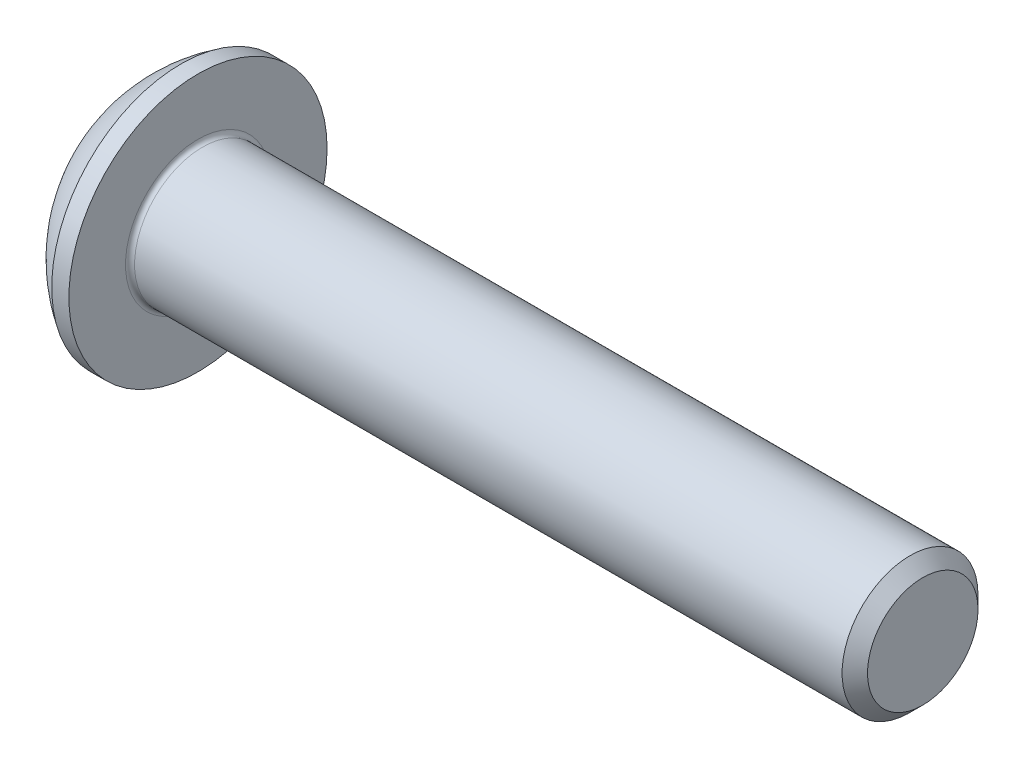
ISO-10303-21;
HEADER;
FILE_DESCRIPTION(('STEP AP214'),'2;1');
FILE_NAME('part.step','',(''),(''),'','','');
FILE_SCHEMA(('AUTOMOTIVE_DESIGN { 1 0 10303 214 1 1 1 1 }'));
ENDSEC;
DATA;
#1=APPLICATION_CONTEXT('core data for automotive mechanical design processes');
#2=APPLICATION_PROTOCOL_DEFINITION('international standard','automotive_design',2000,#1);
#3=PRODUCT_CONTEXT('',#1,'mechanical');
#4=PRODUCT('Part','Part','',(#3));
#5=PRODUCT_RELATED_PRODUCT_CATEGORY('part','',(#4));
#6=PRODUCT_DEFINITION_FORMATION('','',#4);
#7=PRODUCT_DEFINITION_CONTEXT('part definition',#1,'design');
#8=PRODUCT_DEFINITION('design','',#6,#7);
#9=PRODUCT_DEFINITION_SHAPE('','',#8);
#10=(LENGTH_UNIT() NAMED_UNIT(*) SI_UNIT(.MILLI.,.METRE.));
#11=(NAMED_UNIT(*) PLANE_ANGLE_UNIT() SI_UNIT($,.RADIAN.));
#12=(NAMED_UNIT(*) SI_UNIT($,.STERADIAN.) SOLID_ANGLE_UNIT());
#13=UNCERTAINTY_MEASURE_WITH_UNIT(LENGTH_MEASURE(1.E-05),#10,'distance_accuracy_value','');
#14=(GEOMETRIC_REPRESENTATION_CONTEXT(3) GLOBAL_UNCERTAINTY_ASSIGNED_CONTEXT((#13)) GLOBAL_UNIT_ASSIGNED_CONTEXT((#10,
#11,#12)) REPRESENTATION_CONTEXT('',''));
#15=CARTESIAN_POINT('',(0.,0.,0.));
#16=DIRECTION('',(0.,0.,1.));
#17=DIRECTION('',(1.,0.,0.));
#18=AXIS2_PLACEMENT_3D('',#15,#16,#17);
#19=CARTESIAN_POINT('',(3.03181051518725,0.,0.));
#20=DIRECTION('',(1.,0.,0.));
#21=DIRECTION('',(0.,1.,0.));
#22=AXIS2_PLACEMENT_3D('',#19,#20,#21);
#23=SPHERICAL_SURFACE('',#22,3.35);
#24=CARTESIAN_POINT('',(0.,0.,0.));
#25=DIRECTION('',(1.,0.,0.));
#26=DIRECTION('',(0.,0.,-1.));
#27=AXIS2_PLACEMENT_3D('',#24,#25,#26);
#28=CIRCLE('',#27,1.425);
#29=CARTESIAN_POINT('',(0.,0.,-1.425));
#30=VERTEX_POINT('',#29);
#31=EDGE_CURVE('E189',#30,#30,#28,.T.);
#32=ORIENTED_EDGE('',*,*,#31,.T.);
#33=EDGE_LOOP('',(#32));
#34=FACE_BOUND('',#33,.T.);
#35=CARTESIAN_POINT('',(1.27112882902135,0.,0.));
#36=DIRECTION('',(1.,0.,0.));
#37=DIRECTION('',(0.,0.,-1.));
#38=AXIS2_PLACEMENT_3D('',#35,#36,#37);
#39=CIRCLE('',#38,2.85);
#40=CARTESIAN_POINT('',(1.27112882902135,0.,-2.85));
#41=VERTEX_POINT('',#40);
#42=EDGE_CURVE('E176',#41,#41,#39,.T.);
#43=ORIENTED_EDGE('',*,*,#42,.F.);
#44=EDGE_LOOP('',(#43));
#45=FACE_BOUND('',#44,.T.);
#46=ADVANCED_FACE('F34',(#34,#45),#23,.T.);
#47=CARTESIAN_POINT('',(0.,1.425,0.));
#48=DIRECTION('',(-1.,0.,0.));
#49=DIRECTION('',(0.,0.,1.));
#50=AXIS2_PLACEMENT_3D('',#47,#48,#49);
#51=PLANE('',#50);
#52=DIRECTION('',(0.,0.5,-0.866025403784439));
#53=VECTOR('',#52,1.);
#54=CARTESIAN_POINT('',(0.,0.577350269189626,1.));
#55=LINE('',#54,#53);
#56=CARTESIAN_POINT('',(0.,0.577350269189626,1.));
#57=VERTEX_POINT('',#56);
#58=CARTESIAN_POINT('',(0.,1.15470053837925,0.));
#59=VERTEX_POINT('',#58);
#60=EDGE_CURVE('E156',#57,#59,#55,.T.);
#61=ORIENTED_EDGE('',*,*,#60,.F.);
#62=DIRECTION('',(0.,1.,0.));
#63=VECTOR('',#62,1.);
#64=CARTESIAN_POINT('',(0.,-0.577350269189626,1.));
#65=LINE('',#64,#63);
#66=CARTESIAN_POINT('',(0.,-0.577350269189626,1.));
#67=VERTEX_POINT('',#66);
#68=EDGE_CURVE('E153',#67,#57,#65,.T.);
#69=ORIENTED_EDGE('',*,*,#68,.F.);
#70=DIRECTION('',(0.,0.5,0.866025403784439));
#71=VECTOR('',#70,1.);
#72=CARTESIAN_POINT('',(0.,-1.15470053837925,0.));
#73=LINE('',#72,#71);
#74=CARTESIAN_POINT('',(0.,-1.15470053837925,0.));
#75=VERTEX_POINT('',#74);
#76=EDGE_CURVE('E151',#75,#67,#73,.T.);
#77=ORIENTED_EDGE('',*,*,#76,.F.);
#78=DIRECTION('',(0.,-0.5,0.866025403784438));
#79=VECTOR('',#78,1.);
#80=CARTESIAN_POINT('',(0.,-0.577350269189625,-1.));
#81=LINE('',#80,#79);
#82=CARTESIAN_POINT('',(0.,-0.577350269189625,-1.));
#83=VERTEX_POINT('',#82);
#84=EDGE_CURVE('E149',#83,#75,#81,.T.);
#85=ORIENTED_EDGE('',*,*,#84,.F.);
#86=DIRECTION('',(0.,-1.,0.));
#87=VECTOR('',#86,1.);
#88=CARTESIAN_POINT('',(0.,0.577350269189626,-1.));
#89=LINE('',#88,#87);
#90=CARTESIAN_POINT('',(0.,0.577350269189626,-1.));
#91=VERTEX_POINT('',#90);
#92=EDGE_CURVE('E123',#91,#83,#89,.T.);
#93=ORIENTED_EDGE('',*,*,#92,.F.);
#94=DIRECTION('',(0.,-0.5,-0.866025403784439));
#95=VECTOR('',#94,1.);
#96=CARTESIAN_POINT('',(0.,1.15470053837925,0.));
#97=LINE('',#96,#95);
#98=EDGE_CURVE('E116',#59,#91,#97,.T.);
#99=ORIENTED_EDGE('',*,*,#98,.F.);
#100=EDGE_LOOP('',(#61,#69,#77,#85,#93,#99));
#101=FACE_BOUND('',#100,.T.);
#102=ORIENTED_EDGE('',*,*,#31,.F.);
#103=EDGE_LOOP('',(#102));
#104=FACE_BOUND('',#103,.T.);
#105=ADVANCED_FACE('F211',(#101,#104),#51,.T.);
#106=CARTESIAN_POINT('',(17.65,0.,0.));
#107=DIRECTION('',(1.,0.,0.));
#108=DIRECTION('',(0.,0.,-1.));
#109=AXIS2_PLACEMENT_3D('',#106,#107,#108);
#110=PLANE('',#109);
#111=CARTESIAN_POINT('',(17.65,0.,0.));
#112=DIRECTION('',(1.,0.,0.));
#113=DIRECTION('',(0.,0.,-1.));
#114=AXIS2_PLACEMENT_3D('',#111,#112,#113);
#115=CIRCLE('',#114,1.2195);
#116=CARTESIAN_POINT('',(17.65,0.,-1.2195));
#117=VERTEX_POINT('',#116);
#118=EDGE_CURVE('E186',#117,#117,#115,.T.);
#119=ORIENTED_EDGE('',*,*,#118,.T.);
#120=EDGE_LOOP('',(#119));
#121=FACE_BOUND('',#120,.T.);
#122=ADVANCED_FACE('F216',(#121),#110,.T.);
#123=CARTESIAN_POINT('',(17.65,0.,0.));
#124=DIRECTION('',(-1.,0.,0.));
#125=DIRECTION('',(0.,0.,1.));
#126=AXIS2_PLACEMENT_3D('',#123,#124,#125);
#127=CONICAL_SURFACE('',#126,1.2195,0.785398163397449);
#128=CARTESIAN_POINT('',(17.3695,0.,0.));
#129=DIRECTION('',(1.,0.,0.));
#130=DIRECTION('',(0.,0.,-1.));
#131=AXIS2_PLACEMENT_3D('',#128,#129,#130);
#132=CIRCLE('',#131,1.5);
#133=CARTESIAN_POINT('',(17.3695,0.,-1.5));
#134=VERTEX_POINT('',#133);
#135=EDGE_CURVE('E183',#134,#134,#132,.T.);
#136=ORIENTED_EDGE('',*,*,#135,.T.);
#137=EDGE_LOOP('',(#136));
#138=FACE_BOUND('',#137,.T.);
#139=ORIENTED_EDGE('',*,*,#118,.F.);
#140=EDGE_LOOP('',(#139));
#141=FACE_BOUND('',#140,.T.);
#142=ADVANCED_FACE('F223',(#138,#141),#127,.T.);
#143=CARTESIAN_POINT('',(-3.64348996551984,0.,0.));
#144=DIRECTION('',(1.,0.,0.));
#145=DIRECTION('',(0.,0.,-1.));
#146=AXIS2_PLACEMENT_3D('',#143,#144,#145);
#147=CYLINDRICAL_SURFACE('',#146,1.5);
#148=CARTESIAN_POINT('',(1.75,0.,0.));
#149=DIRECTION('',(1.,0.,0.));
#150=DIRECTION('',(0.,0.,-1.));
#151=AXIS2_PLACEMENT_3D('',#148,#149,#150);
#152=CIRCLE('',#151,1.5);
#153=CARTESIAN_POINT('',(1.75,0.,-1.5));
#154=VERTEX_POINT('',#153);
#155=EDGE_CURVE('E42',#154,#154,#152,.T.);
#156=ORIENTED_EDGE('',*,*,#155,.T.);
#157=EDGE_LOOP('',(#156));
#158=FACE_BOUND('',#157,.T.);
#159=ORIENTED_EDGE('',*,*,#135,.F.);
#160=EDGE_LOOP('',(#159));
#161=FACE_BOUND('',#160,.T.);
#162=ADVANCED_FACE('F194',(#158,#161),#147,.T.);
#163=CARTESIAN_POINT('',(1.65,1.5,0.));
#164=DIRECTION('',(1.,0.,0.));
#165=DIRECTION('',(0.,0.,-1.));
#166=AXIS2_PLACEMENT_3D('',#163,#164,#165);
#167=PLANE('',#166);
#168=CARTESIAN_POINT('',(1.65,0.,0.));
#169=DIRECTION('',(1.,0.,0.));
#170=DIRECTION('',(0.,0.,-1.));
#171=AXIS2_PLACEMENT_3D('',#168,#169,#170);
#172=CIRCLE('',#171,1.6);
#173=CARTESIAN_POINT('',(1.65,0.,-1.6));
#174=VERTEX_POINT('',#173);
#175=EDGE_CURVE('E11',#174,#174,#172,.F.);
#176=ORIENTED_EDGE('',*,*,#175,.T.);
#177=EDGE_LOOP('',(#176));
#178=FACE_BOUND('',#177,.T.);
#179=CARTESIAN_POINT('',(1.65,0.,0.));
#180=DIRECTION('',(1.,0.,0.));
#181=DIRECTION('',(0.,0.,-1.));
#182=AXIS2_PLACEMENT_3D('',#179,#180,#181);
#183=CIRCLE('',#182,2.85);
#184=CARTESIAN_POINT('',(1.65,0.,-2.85));
#185=VERTEX_POINT('',#184);
#186=EDGE_CURVE('E180',#185,#185,#183,.T.);
#187=ORIENTED_EDGE('',*,*,#186,.T.);
#188=EDGE_LOOP('',(#187));
#189=FACE_BOUND('',#188,.T.);
#190=ADVANCED_FACE('F206',(#178,#189),#167,.T.);
#191=CARTESIAN_POINT('',(-3.64348996551984,0.,0.));
#192=DIRECTION('',(1.,0.,0.));
#193=DIRECTION('',(0.,0.,-1.));
#194=AXIS2_PLACEMENT_3D('',#191,#192,#193);
#195=CYLINDRICAL_SURFACE('',#194,2.85);
#196=ORIENTED_EDGE('',*,*,#42,.T.);
#197=EDGE_LOOP('',(#196));
#198=FACE_BOUND('',#197,.T.);
#199=ORIENTED_EDGE('',*,*,#186,.F.);
#200=EDGE_LOOP('',(#199));
#201=FACE_BOUND('',#200,.T.);
#202=ADVANCED_FACE('F198',(#198,#201),#195,.T.);
#203=CARTESIAN_POINT('',(1.75,0.,0.));
#204=DIRECTION('',(1.,0.,0.));
#205=DIRECTION('',(0.,0.,-1.));
#206=AXIS2_PLACEMENT_3D('',#203,#204,#205);
#207=TOROIDAL_SURFACE('',#206,1.6,0.1);
#208=ORIENTED_EDGE('',*,*,#175,.F.);
#209=EDGE_LOOP('',(#208));
#210=FACE_BOUND('',#209,.T.);
#211=ORIENTED_EDGE('',*,*,#155,.F.);
#212=EDGE_LOOP('',(#211));
#213=FACE_BOUND('',#212,.T.);
#214=ADVANCED_FACE('F36',(#210,#213),#207,.F.);
#215=CARTESIAN_POINT('',(1.04,0.577350269189626,-1.));
#216=DIRECTION('',(0.,0.,-1.));
#217=DIRECTION('',(0.,1.,0.));
#218=AXIS2_PLACEMENT_3D('',#215,#216,#217);
#219=PLANE('',#218);
#220=DIRECTION('',(0.,-1.,0.));
#221=VECTOR('',#220,1.);
#222=CARTESIAN_POINT('',(1.04,0.577350269189626,-1.));
#223=LINE('',#222,#221);
#224=CARTESIAN_POINT('',(1.04,0.577350269189626,-1.));
#225=VERTEX_POINT('',#224);
#226=CARTESIAN_POINT('',(1.04,0.,-1.));
#227=VERTEX_POINT('',#226);
#228=EDGE_CURVE('E115',#225,#227,#223,.T.);
#229=ORIENTED_EDGE('',*,*,#228,.F.);
#230=DIRECTION('',(-1.,0.,0.));
#231=VECTOR('',#230,1.);
#232=CARTESIAN_POINT('',(1.04,0.577350269189626,-1.));
#233=LINE('',#232,#231);
#234=EDGE_CURVE('E161',#225,#91,#233,.T.);
#235=ORIENTED_EDGE('',*,*,#234,.T.);
#236=ORIENTED_EDGE('',*,*,#92,.T.);
#237=DIRECTION('',(-1.,0.,0.));
#238=VECTOR('',#237,1.);
#239=CARTESIAN_POINT('',(1.04,-0.577350269189625,-1.));
#240=LINE('',#239,#238);
#241=CARTESIAN_POINT('',(1.04,-0.577350269189625,-1.));
#242=VERTEX_POINT('',#241);
#243=EDGE_CURVE('E120',#242,#83,#240,.T.);
#244=ORIENTED_EDGE('',*,*,#243,.F.);
#245=EDGE_CURVE('E105',#227,#242,#223,.T.);
#246=ORIENTED_EDGE('',*,*,#245,.F.);
#247=EDGE_LOOP('',(#229,#235,#236,#244,#246));
#248=FACE_BOUND('',#247,.T.);
#249=ADVANCED_FACE('F121',(#248),#219,.F.);
#250=CARTESIAN_POINT('',(1.04,1.15470053837925,0.));
#251=DIRECTION('',(0.,0.866025403784439,-0.5));
#252=DIRECTION('',(0.,0.5,0.866025403784439));
#253=AXIS2_PLACEMENT_3D('',#250,#251,#252);
#254=PLANE('',#253);
#255=DIRECTION('',(0.,-0.5,-0.866025403784439));
#256=VECTOR('',#255,1.);
#257=CARTESIAN_POINT('',(1.04,1.15470053837925,0.));
#258=LINE('',#257,#256);
#259=CARTESIAN_POINT('',(1.04,1.15470053837925,0.));
#260=VERTEX_POINT('',#259);
#261=CARTESIAN_POINT('',(1.04,0.866025403784439,-0.500000000000001));
#262=VERTEX_POINT('',#261);
#263=EDGE_CURVE('E127',#260,#262,#258,.T.);
#264=ORIENTED_EDGE('',*,*,#263,.F.);
#265=DIRECTION('',(-1.,0.,0.));
#266=VECTOR('',#265,1.);
#267=CARTESIAN_POINT('',(1.04,1.15470053837925,0.));
#268=LINE('',#267,#266);
#269=EDGE_CURVE('E163',#260,#59,#268,.T.);
#270=ORIENTED_EDGE('',*,*,#269,.T.);
#271=ORIENTED_EDGE('',*,*,#98,.T.);
#272=ORIENTED_EDGE('',*,*,#234,.F.);
#273=EDGE_CURVE('E145',#262,#225,#258,.T.);
#274=ORIENTED_EDGE('',*,*,#273,.F.);
#275=EDGE_LOOP('',(#264,#270,#271,#272,#274));
#276=FACE_BOUND('',#275,.T.);
#277=ADVANCED_FACE('F204',(#276),#254,.F.);
#278=CARTESIAN_POINT('',(1.04,0.577350269189626,1.));
#279=DIRECTION('',(0.,0.866025403784439,0.5));
#280=DIRECTION('',(0.,-0.5,0.866025403784439));
#281=AXIS2_PLACEMENT_3D('',#278,#279,#280);
#282=PLANE('',#281);
#283=DIRECTION('',(0.,0.5,-0.866025403784439));
#284=VECTOR('',#283,1.);
#285=CARTESIAN_POINT('',(1.04,0.577350269189626,1.));
#286=LINE('',#285,#284);
#287=CARTESIAN_POINT('',(1.04,0.577350269189626,1.));
#288=VERTEX_POINT('',#287);
#289=CARTESIAN_POINT('',(1.04,0.866025403784438,0.5));
#290=VERTEX_POINT('',#289);
#291=EDGE_CURVE('E49',#288,#290,#286,.T.);
#292=ORIENTED_EDGE('',*,*,#291,.F.);
#293=DIRECTION('',(-1.,0.,0.));
#294=VECTOR('',#293,1.);
#295=CARTESIAN_POINT('',(1.04,0.577350269189626,1.));
#296=LINE('',#295,#294);
#297=EDGE_CURVE('E166',#288,#57,#296,.T.);
#298=ORIENTED_EDGE('',*,*,#297,.T.);
#299=ORIENTED_EDGE('',*,*,#60,.T.);
#300=ORIENTED_EDGE('',*,*,#269,.F.);
#301=EDGE_CURVE('E143',#290,#260,#286,.T.);
#302=ORIENTED_EDGE('',*,*,#301,.F.);
#303=EDGE_LOOP('',(#292,#298,#299,#300,#302));
#304=FACE_BOUND('',#303,.T.);
#305=ADVANCED_FACE('F248',(#304),#282,.F.);
#306=CARTESIAN_POINT('',(1.04,-0.577350269189626,1.));
#307=DIRECTION('',(0.,0.,1.));
#308=DIRECTION('',(1.,0.,0.));
#309=AXIS2_PLACEMENT_3D('',#306,#307,#308);
#310=PLANE('',#309);
#311=DIRECTION('',(0.,1.,0.));
#312=VECTOR('',#311,1.);
#313=CARTESIAN_POINT('',(1.04,-0.577350269189626,1.));
#314=LINE('',#313,#312);
#315=CARTESIAN_POINT('',(1.04,-0.577350269189626,1.));
#316=VERTEX_POINT('',#315);
#317=CARTESIAN_POINT('',(1.04,0.,1.));
#318=VERTEX_POINT('',#317);
#319=EDGE_CURVE('E140',#316,#318,#314,.T.);
#320=ORIENTED_EDGE('',*,*,#319,.F.);
#321=DIRECTION('',(-1.,0.,0.));
#322=VECTOR('',#321,1.);
#323=CARTESIAN_POINT('',(1.04,-0.577350269189626,1.));
#324=LINE('',#323,#322);
#325=EDGE_CURVE('E169',#316,#67,#324,.T.);
#326=ORIENTED_EDGE('',*,*,#325,.T.);
#327=ORIENTED_EDGE('',*,*,#68,.T.);
#328=ORIENTED_EDGE('',*,*,#297,.F.);
#329=EDGE_CURVE('E139',#318,#288,#314,.T.);
#330=ORIENTED_EDGE('',*,*,#329,.F.);
#331=EDGE_LOOP('',(#320,#326,#327,#328,#330));
#332=FACE_BOUND('',#331,.T.);
#333=ADVANCED_FACE('F244',(#332),#310,.F.);
#334=CARTESIAN_POINT('',(1.04,-1.15470053837925,0.));
#335=DIRECTION('',(0.,-0.866025403784439,0.5));
#336=DIRECTION('',(0.,-0.5,-0.866025403784439));
#337=AXIS2_PLACEMENT_3D('',#334,#335,#336);
#338=PLANE('',#337);
#339=DIRECTION('',(0.,0.5,0.866025403784439));
#340=VECTOR('',#339,1.);
#341=CARTESIAN_POINT('',(1.04,-1.15470053837925,0.));
#342=LINE('',#341,#340);
#343=CARTESIAN_POINT('',(1.04,-1.15470053837925,0.));
#344=VERTEX_POINT('',#343);
#345=CARTESIAN_POINT('',(1.04,-0.866025403784439,0.5));
#346=VERTEX_POINT('',#345);
#347=EDGE_CURVE('E135',#344,#346,#342,.T.);
#348=ORIENTED_EDGE('',*,*,#347,.F.);
#349=DIRECTION('',(-1.,0.,0.));
#350=VECTOR('',#349,1.);
#351=CARTESIAN_POINT('',(1.04,-1.15470053837925,0.));
#352=LINE('',#351,#350);
#353=EDGE_CURVE('E126',#344,#75,#352,.T.);
#354=ORIENTED_EDGE('',*,*,#353,.T.);
#355=ORIENTED_EDGE('',*,*,#76,.T.);
#356=ORIENTED_EDGE('',*,*,#325,.F.);
#357=EDGE_CURVE('E133',#346,#316,#342,.T.);
#358=ORIENTED_EDGE('',*,*,#357,.F.);
#359=EDGE_LOOP('',(#348,#354,#355,#356,#358));
#360=FACE_BOUND('',#359,.T.);
#361=ADVANCED_FACE('F241',(#360),#338,.F.);
#362=CARTESIAN_POINT('',(1.04,-0.577350269189625,-1.));
#363=DIRECTION('',(0.,-0.866025403784438,-0.5));
#364=DIRECTION('',(0.,0.5,-0.866025403784438));
#365=AXIS2_PLACEMENT_3D('',#362,#363,#364);
#366=PLANE('',#365);
#367=DIRECTION('',(0.,-0.5,0.866025403784438));
#368=VECTOR('',#367,1.);
#369=CARTESIAN_POINT('',(1.04,-0.577350269189625,-1.));
#370=LINE('',#369,#368);
#371=CARTESIAN_POINT('',(1.04,-0.866025403784438,-0.5));
#372=VERTEX_POINT('',#371);
#373=EDGE_CURVE('E109',#242,#372,#370,.T.);
#374=ORIENTED_EDGE('',*,*,#373,.F.);
#375=ORIENTED_EDGE('',*,*,#243,.T.);
#376=ORIENTED_EDGE('',*,*,#84,.T.);
#377=ORIENTED_EDGE('',*,*,#353,.F.);
#378=EDGE_CURVE('E132',#372,#344,#370,.T.);
#379=ORIENTED_EDGE('',*,*,#378,.F.);
#380=EDGE_LOOP('',(#374,#375,#376,#377,#379));
#381=FACE_BOUND('',#380,.T.);
#382=ADVANCED_FACE('F130',(#381),#366,.F.);
#383=CARTESIAN_POINT('',(1.04,0.,0.));
#384=DIRECTION('',(-1.,0.,0.));
#385=DIRECTION('',(0.,0.,1.));
#386=AXIS2_PLACEMENT_3D('',#383,#384,#385);
#387=PLANE('',#386);
#388=CARTESIAN_POINT('',(1.04,0.,0.));
#389=DIRECTION('',(1.,0.,0.));
#390=DIRECTION('',(0.,0.,-1.));
#391=AXIS2_PLACEMENT_3D('',#388,#389,#390);
#392=CIRCLE('',#391,1.);
#393=EDGE_CURVE('E276',#318,#346,#392,.T.);
#394=ORIENTED_EDGE('',*,*,#393,.T.);
#395=ORIENTED_EDGE('',*,*,#357,.T.);
#396=ORIENTED_EDGE('',*,*,#319,.T.);
#397=EDGE_LOOP('',(#394,#395,#396));
#398=FACE_BOUND('',#397,.T.);
#399=ADVANCED_FACE('F240',(#398),#387,.T.);
#400=EDGE_CURVE('E282',#346,#372,#392,.T.);
#401=ORIENTED_EDGE('',*,*,#400,.T.);
#402=ORIENTED_EDGE('',*,*,#378,.T.);
#403=ORIENTED_EDGE('',*,*,#347,.T.);
#404=EDGE_LOOP('',(#401,#402,#403));
#405=FACE_BOUND('',#404,.T.);
#406=ADVANCED_FACE('F257',(#405),#387,.T.);
#407=EDGE_CURVE('E111',#372,#227,#392,.T.);
#408=ORIENTED_EDGE('',*,*,#407,.T.);
#409=ORIENTED_EDGE('',*,*,#245,.T.);
#410=ORIENTED_EDGE('',*,*,#373,.T.);
#411=EDGE_LOOP('',(#408,#409,#410));
#412=FACE_BOUND('',#411,.T.);
#413=ADVANCED_FACE('F107',(#412),#387,.T.);
#414=EDGE_CURVE('E174',#227,#262,#392,.T.);
#415=ORIENTED_EDGE('',*,*,#414,.T.);
#416=ORIENTED_EDGE('',*,*,#273,.T.);
#417=ORIENTED_EDGE('',*,*,#228,.T.);
#418=EDGE_LOOP('',(#415,#416,#417));
#419=FACE_BOUND('',#418,.T.);
#420=ADVANCED_FACE('F268',(#419),#387,.T.);
#421=EDGE_CURVE('E177',#262,#290,#392,.T.);
#422=ORIENTED_EDGE('',*,*,#421,.T.);
#423=ORIENTED_EDGE('',*,*,#301,.T.);
#424=ORIENTED_EDGE('',*,*,#263,.T.);
#425=EDGE_LOOP('',(#422,#423,#424));
#426=FACE_BOUND('',#425,.T.);
#427=ADVANCED_FACE('F264',(#426),#387,.T.);
#428=EDGE_CURVE('E271',#290,#318,#392,.T.);
#429=ORIENTED_EDGE('',*,*,#428,.T.);
#430=ORIENTED_EDGE('',*,*,#329,.T.);
#431=ORIENTED_EDGE('',*,*,#291,.T.);
#432=EDGE_LOOP('',(#429,#430,#431));
#433=FACE_BOUND('',#432,.T.);
#434=ADVANCED_FACE('F235',(#433),#387,.T.);
#435=CARTESIAN_POINT('',(1.61735026918963,0.,0.));
#436=DIRECTION('',(-1.,0.,0.));
#437=DIRECTION('',(0.,0.,1.));
#438=AXIS2_PLACEMENT_3D('',#435,#436,#437);
#439=CONICAL_SURFACE('',#438,0.,1.04719755119659);
#440=ORIENTED_EDGE('',*,*,#414,.F.);
#441=ORIENTED_EDGE('',*,*,#407,.F.);
#442=ORIENTED_EDGE('',*,*,#400,.F.);
#443=ORIENTED_EDGE('',*,*,#393,.F.);
#444=ORIENTED_EDGE('',*,*,#428,.F.);
#445=ORIENTED_EDGE('',*,*,#421,.F.);
#446=EDGE_LOOP('',(#440,#441,#442,#443,#444,#445));
#447=FACE_BOUND('',#446,.T.);
#448=CARTESIAN_POINT('',(1.61735026918963,0.,0.));
#449=VERTEX_POINT('',#448);
#450=VERTEX_LOOP('',#449);
#451=FACE_BOUND('',#450,.T.);
#452=ADVANCED_FACE('F233',(#447,#451),#439,.F.);
#453=CLOSED_SHELL('',(#46,#105,#122,#142,#162,#190,#202,#214,#249,#277,#305,#333,#361,#382,#399,
#406,#413,#420,#427,#434,#452));
#454=MANIFOLD_SOLID_BREP('B2',#453);
#455=ADVANCED_BREP_SHAPE_REPRESENTATION('',(#18,#454),#14);
#456=SHAPE_DEFINITION_REPRESENTATION(#9,#455);
ENDSEC;
END-ISO-10303-21;
